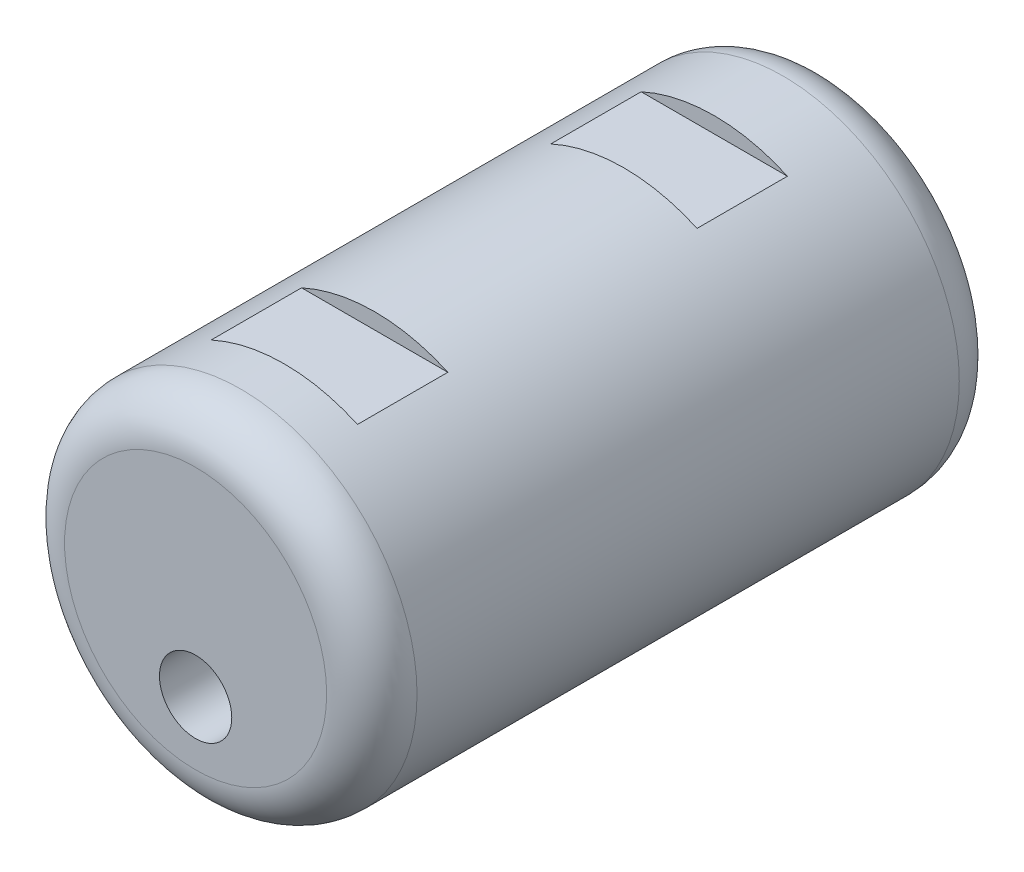
ISO-10303-21;
HEADER;
FILE_DESCRIPTION(('STEP AP214'),'2;1');
FILE_NAME('part.step','',(''),(''),'','','');
FILE_SCHEMA(('AUTOMOTIVE_DESIGN { 1 0 10303 214 1 1 1 1 }'));
ENDSEC;
DATA;
#1=APPLICATION_CONTEXT('core data for automotive mechanical design processes');
#2=APPLICATION_PROTOCOL_DEFINITION('international standard','automotive_design',2000,#1);
#3=PRODUCT_CONTEXT('',#1,'mechanical');
#4=PRODUCT('Part','Part','',(#3));
#5=PRODUCT_RELATED_PRODUCT_CATEGORY('part','',(#4));
#6=PRODUCT_DEFINITION_FORMATION('','',#4);
#7=PRODUCT_DEFINITION_CONTEXT('part definition',#1,'design');
#8=PRODUCT_DEFINITION('design','',#6,#7);
#9=PRODUCT_DEFINITION_SHAPE('','',#8);
#10=(LENGTH_UNIT() NAMED_UNIT(*) SI_UNIT(.MILLI.,.METRE.));
#11=(NAMED_UNIT(*) PLANE_ANGLE_UNIT() SI_UNIT($,.RADIAN.));
#12=(NAMED_UNIT(*) SI_UNIT($,.STERADIAN.) SOLID_ANGLE_UNIT());
#13=UNCERTAINTY_MEASURE_WITH_UNIT(LENGTH_MEASURE(1.E-05),#10,'distance_accuracy_value','');
#14=(GEOMETRIC_REPRESENTATION_CONTEXT(3) GLOBAL_UNCERTAINTY_ASSIGNED_CONTEXT((#13)) GLOBAL_UNIT_ASSIGNED_CONTEXT((#10,
#11,#12)) REPRESENTATION_CONTEXT('',''));
#15=CARTESIAN_POINT('',(0.,0.,0.));
#16=DIRECTION('',(0.,0.,1.));
#17=DIRECTION('',(1.,0.,0.));
#18=AXIS2_PLACEMENT_3D('',#15,#16,#17);
#19=CARTESIAN_POINT('',(0.,0.,14.));
#20=DIRECTION('',(0.,0.,-1.));
#21=DIRECTION('',(-1.,0.,0.));
#22=AXIS2_PLACEMENT_3D('',#19,#20,#21);
#23=CYLINDRICAL_SURFACE('',#22,3.9);
#24=DIRECTION('',(0.,0.,-1.));
#25=VECTOR('',#24,1.);
#26=CARTESIAN_POINT('',(1.61869536060481,3.54821438607597,14.));
#27=LINE('',#26,#25);
#28=CARTESIAN_POINT('',(1.61869536060481,3.54821438607597,4.52188201607393));
#29=VERTEX_POINT('',#28);
#30=CARTESIAN_POINT('',(1.61869536060481,3.54821438607597,2.52188201607393));
#31=VERTEX_POINT('',#30);
#32=EDGE_CURVE('E92',#29,#31,#27,.T.);
#33=ORIENTED_EDGE('',*,*,#32,.F.);
#34=CARTESIAN_POINT('',(0.,0.,4.52188201607393));
#35=DIRECTION('',(0.,0.,-1.));
#36=DIRECTION('',(-1.,0.,0.));
#37=AXIS2_PLACEMENT_3D('',#34,#35,#36);
#38=CIRCLE('',#37,3.9);
#39=CARTESIAN_POINT('',(-1.61869536060481,3.54821438607597,4.52188201607393));
#40=VERTEX_POINT('',#39);
#41=EDGE_CURVE('E96',#40,#29,#38,.T.);
#42=ORIENTED_EDGE('',*,*,#41,.F.);
#43=DIRECTION('',(0.,0.,-1.));
#44=VECTOR('',#43,1.);
#45=CARTESIAN_POINT('',(-1.61869536060481,3.54821438607597,14.));
#46=LINE('',#45,#44);
#47=CARTESIAN_POINT('',(-1.61869536060481,3.54821438607597,2.52188201607393));
#48=VERTEX_POINT('',#47);
#49=EDGE_CURVE('E98',#48,#40,#46,.F.);
#50=ORIENTED_EDGE('',*,*,#49,.F.);
#51=CARTESIAN_POINT('',(0.,0.,2.52188201607393));
#52=DIRECTION('',(0.,0.,1.));
#53=DIRECTION('',(1.,0.,0.));
#54=AXIS2_PLACEMENT_3D('',#51,#52,#53);
#55=CIRCLE('',#54,3.9);
#56=EDGE_CURVE('E94',#31,#48,#55,.T.);
#57=ORIENTED_EDGE('',*,*,#56,.F.);
#58=EDGE_LOOP('',(#33,#42,#50,#57));
#59=FACE_BOUND('',#58,.T.);
#60=CARTESIAN_POINT('',(0.,0.,0.999999999999999));
#61=DIRECTION('',(0.,0.,1.));
#62=DIRECTION('',(1.,0.,0.));
#63=AXIS2_PLACEMENT_3D('',#60,#61,#62);
#64=CIRCLE('',#63,3.9);
#65=CARTESIAN_POINT('',(3.9,0.,0.999999999999999));
#66=VERTEX_POINT('',#65);
#67=EDGE_CURVE('E106',#66,#66,#64,.T.);
#68=ORIENTED_EDGE('',*,*,#67,.T.);
#69=EDGE_LOOP('',(#68));
#70=FACE_BOUND('',#69,.T.);
#71=CARTESIAN_POINT('',(0.,0.,13.));
#72=DIRECTION('',(0.,0.,1.));
#73=DIRECTION('',(1.,0.,0.));
#74=AXIS2_PLACEMENT_3D('',#71,#72,#73);
#75=CIRCLE('',#74,3.9);
#76=CARTESIAN_POINT('',(3.9,0.,13.));
#77=VERTEX_POINT('',#76);
#78=EDGE_CURVE('E103',#77,#77,#75,.F.);
#79=ORIENTED_EDGE('',*,*,#78,.T.);
#80=EDGE_LOOP('',(#79));
#81=FACE_BOUND('',#80,.T.);
#82=DIRECTION('',(0.,0.,-1.));
#83=VECTOR('',#82,1.);
#84=CARTESIAN_POINT('',(1.61869536060481,3.54821438607597,14.));
#85=LINE('',#84,#83);
#86=CARTESIAN_POINT('',(1.61869536060481,3.54821438607597,12.036733089657));
#87=VERTEX_POINT('',#86);
#88=CARTESIAN_POINT('',(1.61869536060481,3.54821438607597,10.036733089657));
#89=VERTEX_POINT('',#88);
#90=EDGE_CURVE('E11',#87,#89,#85,.T.);
#91=ORIENTED_EDGE('',*,*,#90,.F.);
#92=CARTESIAN_POINT('',(0.,0.,12.036733089657));
#93=DIRECTION('',(0.,0.,-1.));
#94=DIRECTION('',(-1.,0.,0.));
#95=AXIS2_PLACEMENT_3D('',#92,#93,#94);
#96=CIRCLE('',#95,3.9);
#97=CARTESIAN_POINT('',(-1.61869536060481,3.54821438607597,12.036733089657));
#98=VERTEX_POINT('',#97);
#99=EDGE_CURVE('E77',#98,#87,#96,.T.);
#100=ORIENTED_EDGE('',*,*,#99,.F.);
#101=DIRECTION('',(0.,0.,-1.));
#102=VECTOR('',#101,1.);
#103=CARTESIAN_POINT('',(-1.61869536060481,3.54821438607597,14.));
#104=LINE('',#103,#102);
#105=CARTESIAN_POINT('',(-1.61869536060481,3.54821438607597,10.036733089657));
#106=VERTEX_POINT('',#105);
#107=EDGE_CURVE('E84',#106,#98,#104,.F.);
#108=ORIENTED_EDGE('',*,*,#107,.F.);
#109=CARTESIAN_POINT('',(0.,0.,10.036733089657));
#110=DIRECTION('',(0.,0.,-1.));
#111=DIRECTION('',(-1.,0.,0.));
#112=AXIS2_PLACEMENT_3D('',#109,#110,#111);
#113=CIRCLE('',#112,3.9);
#114=EDGE_CURVE('E44',#106,#89,#113,.T.);
#115=ORIENTED_EDGE('',*,*,#114,.T.);
#116=EDGE_LOOP('',(#91,#100,#108,#115));
#117=FACE_BOUND('',#116,.T.);
#118=ADVANCED_FACE('F36',(#59,#70,#81,#117),#23,.T.);
#119=CARTESIAN_POINT('',(0.,0.,14.));
#120=DIRECTION('',(0.,0.,1.));
#121=DIRECTION('',(1.,0.,0.));
#122=AXIS2_PLACEMENT_3D('',#119,#120,#121);
#123=PLANE('',#122);
#124=CARTESIAN_POINT('',(0.,-1.5,14.));
#125=DIRECTION('',(0.,0.,1.));
#126=DIRECTION('',(1.,0.,0.));
#127=AXIS2_PLACEMENT_3D('',#124,#125,#126);
#128=CIRCLE('',#127,0.8);
#129=CARTESIAN_POINT('',(0.8,-1.5,14.));
#130=VERTEX_POINT('',#129);
#131=EDGE_CURVE('E113',#130,#130,#128,.T.);
#132=ORIENTED_EDGE('',*,*,#131,.F.);
#133=EDGE_LOOP('',(#132));
#134=FACE_BOUND('',#133,.T.);
#135=CARTESIAN_POINT('',(0.,0.,14.));
#136=DIRECTION('',(0.,0.,1.));
#137=DIRECTION('',(1.,0.,0.));
#138=AXIS2_PLACEMENT_3D('',#135,#136,#137);
#139=CIRCLE('',#138,2.9);
#140=CARTESIAN_POINT('',(2.9,0.,14.));
#141=VERTEX_POINT('',#140);
#142=EDGE_CURVE('E109',#141,#141,#139,.T.);
#143=ORIENTED_EDGE('',*,*,#142,.T.);
#144=EDGE_LOOP('',(#143));
#145=FACE_BOUND('',#144,.T.);
#146=ADVANCED_FACE('F151',(#134,#145),#123,.T.);
#147=CARTESIAN_POINT('',(0.,0.,0.));
#148=DIRECTION('',(0.,0.,1.));
#149=DIRECTION('',(1.,0.,0.));
#150=AXIS2_PLACEMENT_3D('',#147,#148,#149);
#151=PLANE('',#150);
#152=CARTESIAN_POINT('',(0.,-1.5,0.));
#153=DIRECTION('',(0.,0.,-1.));
#154=DIRECTION('',(-1.,0.,0.));
#155=AXIS2_PLACEMENT_3D('',#152,#153,#154);
#156=CIRCLE('',#155,0.8);
#157=CARTESIAN_POINT('',(-0.8,-1.5,0.));
#158=VERTEX_POINT('',#157);
#159=EDGE_CURVE('E119',#158,#158,#156,.T.);
#160=ORIENTED_EDGE('',*,*,#159,.F.);
#161=EDGE_LOOP('',(#160));
#162=FACE_BOUND('',#161,.T.);
#163=CARTESIAN_POINT('',(0.,0.,0.));
#164=DIRECTION('',(0.,0.,1.));
#165=DIRECTION('',(1.,0.,0.));
#166=AXIS2_PLACEMENT_3D('',#163,#164,#165);
#167=CIRCLE('',#166,2.9);
#168=CARTESIAN_POINT('',(2.9,0.,0.));
#169=VERTEX_POINT('',#168);
#170=EDGE_CURVE('E100',#169,#169,#167,.F.);
#171=ORIENTED_EDGE('',*,*,#170,.T.);
#172=EDGE_LOOP('',(#171));
#173=FACE_BOUND('',#172,.T.);
#174=ADVANCED_FACE('F156',(#162,#173),#151,.F.);
#175=CARTESIAN_POINT('',(0.,0.,13.));
#176=DIRECTION('',(0.,0.,1.));
#177=DIRECTION('',(1.,0.,0.));
#178=AXIS2_PLACEMENT_3D('',#175,#176,#177);
#179=TOROIDAL_SURFACE('',#178,2.9,1.);
#180=ORIENTED_EDGE('',*,*,#78,.F.);
#181=EDGE_LOOP('',(#180));
#182=FACE_BOUND('',#181,.T.);
#183=ORIENTED_EDGE('',*,*,#142,.F.);
#184=EDGE_LOOP('',(#183));
#185=FACE_BOUND('',#184,.T.);
#186=ADVANCED_FACE('F160',(#182,#185),#179,.T.);
#187=CARTESIAN_POINT('',(0.,0.,0.999999999999999));
#188=DIRECTION('',(0.,0.,1.));
#189=DIRECTION('',(1.,0.,0.));
#190=AXIS2_PLACEMENT_3D('',#187,#188,#189);
#191=TOROIDAL_SURFACE('',#190,2.9,1.);
#192=ORIENTED_EDGE('',*,*,#170,.F.);
#193=EDGE_LOOP('',(#192));
#194=FACE_BOUND('',#193,.T.);
#195=ORIENTED_EDGE('',*,*,#67,.F.);
#196=EDGE_LOOP('',(#195));
#197=FACE_BOUND('',#196,.T.);
#198=ADVANCED_FACE('F38',(#194,#197),#191,.T.);
#199=CARTESIAN_POINT('',(0.,-1.5,9.));
#200=DIRECTION('',(0.,0.,1.));
#201=DIRECTION('',(1.,0.,0.));
#202=AXIS2_PLACEMENT_3D('',#199,#200,#201);
#203=CYLINDRICAL_SURFACE('',#202,0.8);
#204=CARTESIAN_POINT('',(0.,-1.5,9.));
#205=DIRECTION('',(0.,0.,1.));
#206=DIRECTION('',(1.,0.,0.));
#207=AXIS2_PLACEMENT_3D('',#204,#205,#206);
#208=CIRCLE('',#207,0.8);
#209=CARTESIAN_POINT('',(0.8,-1.5,9.));
#210=VERTEX_POINT('',#209);
#211=EDGE_CURVE('E112',#210,#210,#208,.T.);
#212=ORIENTED_EDGE('',*,*,#211,.F.);
#213=EDGE_LOOP('',(#212));
#214=FACE_BOUND('',#213,.T.);
#215=ORIENTED_EDGE('',*,*,#131,.T.);
#216=EDGE_LOOP('',(#215));
#217=FACE_BOUND('',#216,.T.);
#218=ADVANCED_FACE('F167',(#214,#217),#203,.F.);
#219=CARTESIAN_POINT('',(0.,-1.5,9.));
#220=DIRECTION('',(0.,0.,1.));
#221=DIRECTION('',(1.,0.,0.));
#222=AXIS2_PLACEMENT_3D('',#219,#220,#221);
#223=PLANE('',#222);
#224=ORIENTED_EDGE('',*,*,#211,.T.);
#225=EDGE_LOOP('',(#224));
#226=FACE_BOUND('',#225,.T.);
#227=ADVANCED_FACE('F184',(#226),#223,.T.);
#228=CARTESIAN_POINT('',(0.,-1.5,5.));
#229=DIRECTION('',(0.,0.,-1.));
#230=DIRECTION('',(-1.,0.,0.));
#231=AXIS2_PLACEMENT_3D('',#228,#229,#230);
#232=CYLINDRICAL_SURFACE('',#231,0.8);
#233=CARTESIAN_POINT('',(0.,-1.5,5.));
#234=DIRECTION('',(0.,0.,-1.));
#235=DIRECTION('',(-1.,0.,0.));
#236=AXIS2_PLACEMENT_3D('',#233,#234,#235);
#237=CIRCLE('',#236,0.8);
#238=CARTESIAN_POINT('',(-0.8,-1.5,5.));
#239=VERTEX_POINT('',#238);
#240=EDGE_CURVE('E116',#239,#239,#237,.T.);
#241=ORIENTED_EDGE('',*,*,#240,.F.);
#242=EDGE_LOOP('',(#241));
#243=FACE_BOUND('',#242,.T.);
#244=ORIENTED_EDGE('',*,*,#159,.T.);
#245=EDGE_LOOP('',(#244));
#246=FACE_BOUND('',#245,.T.);
#247=ADVANCED_FACE('F147',(#243,#246),#232,.F.);
#248=CARTESIAN_POINT('',(0.,-1.5,5.));
#249=DIRECTION('',(0.,0.,-1.));
#250=DIRECTION('',(-1.,0.,0.));
#251=AXIS2_PLACEMENT_3D('',#248,#249,#250);
#252=PLANE('',#251);
#253=ORIENTED_EDGE('',*,*,#240,.T.);
#254=EDGE_LOOP('',(#253));
#255=FACE_BOUND('',#254,.T.);
#256=ADVANCED_FACE('F140',(#255),#252,.T.);
#257=CARTESIAN_POINT('',(5.,3.9,2.52188201607393));
#258=DIRECTION('',(0.,0.,1.));
#259=DIRECTION('',(1.,0.,0.));
#260=AXIS2_PLACEMENT_3D('',#257,#258,#259);
#261=PLANE('',#260);
#262=DIRECTION('',(-1.,0.,0.));
#263=VECTOR('',#262,1.);
#264=CARTESIAN_POINT('',(5.,3.54821438607597,2.52188201607393));
#265=LINE('',#264,#263);
#266=EDGE_CURVE('E58',#31,#48,#265,.T.);
#267=ORIENTED_EDGE('',*,*,#266,.F.);
#268=ORIENTED_EDGE('',*,*,#56,.T.);
#269=EDGE_LOOP('',(#267,#268));
#270=FACE_BOUND('',#269,.T.);
#271=ADVANCED_FACE('F138',(#270),#261,.T.);
#272=CARTESIAN_POINT('',(5.,3.9,4.52188201607393));
#273=DIRECTION('',(0.,0.,-1.));
#274=DIRECTION('',(-1.,0.,0.));
#275=AXIS2_PLACEMENT_3D('',#272,#273,#274);
#276=PLANE('',#275);
#277=ORIENTED_EDGE('',*,*,#41,.T.);
#278=DIRECTION('',(-1.,0.,0.));
#279=VECTOR('',#278,1.);
#280=CARTESIAN_POINT('',(5.,3.54821438607597,4.52188201607393));
#281=LINE('',#280,#279);
#282=EDGE_CURVE('E122',#29,#40,#281,.T.);
#283=ORIENTED_EDGE('',*,*,#282,.T.);
#284=EDGE_LOOP('',(#277,#283));
#285=FACE_BOUND('',#284,.T.);
#286=ADVANCED_FACE('F131',(#285),#276,.T.);
#287=CARTESIAN_POINT('',(5.,3.54821438607597,2.52188201607393));
#288=DIRECTION('',(0.,1.,0.));
#289=DIRECTION('',(0.,0.,1.));
#290=AXIS2_PLACEMENT_3D('',#287,#288,#289);
#291=PLANE('',#290);
#292=ORIENTED_EDGE('',*,*,#32,.T.);
#293=ORIENTED_EDGE('',*,*,#266,.T.);
#294=ORIENTED_EDGE('',*,*,#49,.T.);
#295=ORIENTED_EDGE('',*,*,#282,.F.);
#296=EDGE_LOOP('',(#292,#293,#294,#295));
#297=FACE_BOUND('',#296,.T.);
#298=ADVANCED_FACE('F136',(#297),#291,.T.);
#299=CARTESIAN_POINT('',(10.,0.,10.036733089657));
#300=DIRECTION('',(0.,0.,-1.));
#301=DIRECTION('',(-1.,0.,0.));
#302=AXIS2_PLACEMENT_3D('',#299,#300,#301);
#303=PLANE('',#302);
#304=DIRECTION('',(-1.,0.,0.));
#305=VECTOR('',#304,1.);
#306=CARTESIAN_POINT('',(10.,3.54821438607597,10.036733089657));
#307=LINE('',#306,#305);
#308=EDGE_CURVE('E50',#89,#106,#307,.T.);
#309=ORIENTED_EDGE('',*,*,#308,.F.);
#310=ORIENTED_EDGE('',*,*,#114,.F.);
#311=EDGE_LOOP('',(#309,#310));
#312=FACE_BOUND('',#311,.T.);
#313=ADVANCED_FACE('F242',(#312),#303,.F.);
#314=CARTESIAN_POINT('',(10.,0.,12.036733089657));
#315=DIRECTION('',(0.,0.,-1.));
#316=DIRECTION('',(-1.,0.,0.));
#317=AXIS2_PLACEMENT_3D('',#314,#315,#316);
#318=PLANE('',#317);
#319=ORIENTED_EDGE('',*,*,#99,.T.);
#320=DIRECTION('',(-1.,0.,0.));
#321=VECTOR('',#320,1.);
#322=CARTESIAN_POINT('',(10.,3.54821438607597,12.036733089657));
#323=LINE('',#322,#321);
#324=EDGE_CURVE('E80',#87,#98,#323,.T.);
#325=ORIENTED_EDGE('',*,*,#324,.T.);
#326=EDGE_LOOP('',(#319,#325));
#327=FACE_BOUND('',#326,.T.);
#328=ADVANCED_FACE('F79',(#327),#318,.T.);
#329=CARTESIAN_POINT('',(10.,3.54821438607597,0.));
#330=DIRECTION('',(0.,1.,0.));
#331=DIRECTION('',(0.,0.,1.));
#332=AXIS2_PLACEMENT_3D('',#329,#330,#331);
#333=PLANE('',#332);
#334=ORIENTED_EDGE('',*,*,#90,.T.);
#335=ORIENTED_EDGE('',*,*,#308,.T.);
#336=ORIENTED_EDGE('',*,*,#107,.T.);
#337=ORIENTED_EDGE('',*,*,#324,.F.);
#338=EDGE_LOOP('',(#334,#335,#336,#337));
#339=FACE_BOUND('',#338,.T.);
#340=ADVANCED_FACE('F86',(#339),#333,.T.);
#341=CLOSED_SHELL('',(#118,#146,#174,#186,#198,#218,#227,#247,#256,#271,#286,#298,#313,#328,#340));
#342=MANIFOLD_SOLID_BREP('B2',#341);
#343=ADVANCED_BREP_SHAPE_REPRESENTATION('',(#18,#342),#14);
#344=SHAPE_DEFINITION_REPRESENTATION(#9,#343);
ENDSEC;
END-ISO-10303-21;
